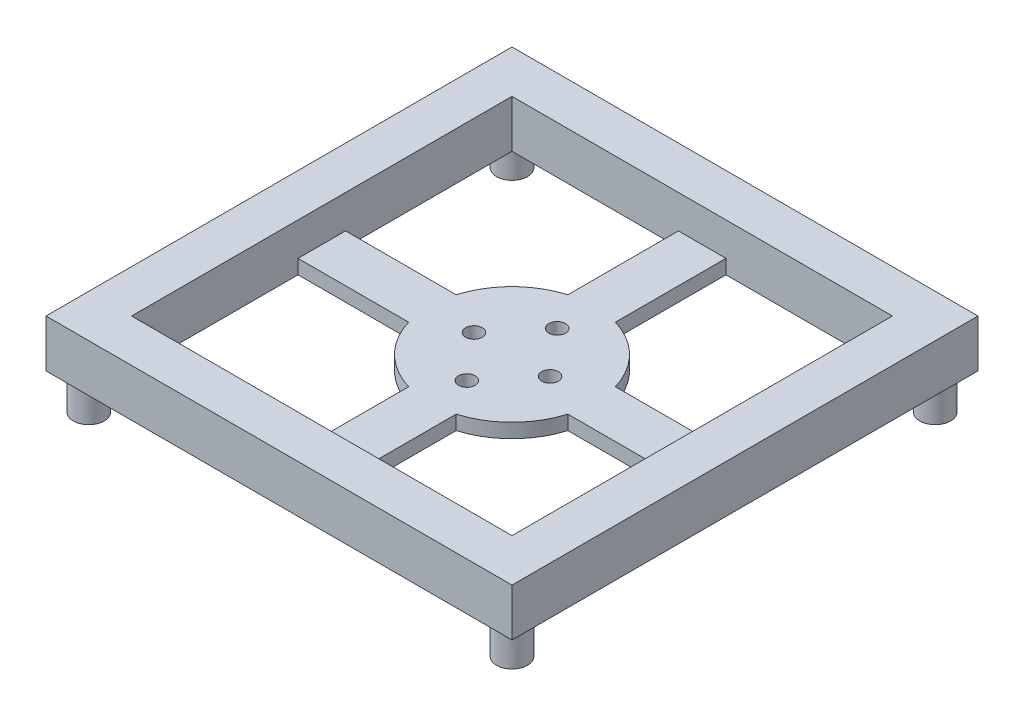
ISO-10303-21;
HEADER;
FILE_DESCRIPTION(('STEP AP214'),'2;1');
FILE_NAME('part.step','',(''),(''),'','','');
FILE_SCHEMA(('AUTOMOTIVE_DESIGN { 1 0 10303 214 1 1 1 1 }'));
ENDSEC;
DATA;
#1=APPLICATION_CONTEXT('core data for automotive mechanical design processes');
#2=APPLICATION_PROTOCOL_DEFINITION('international standard','automotive_design',2000,#1);
#3=PRODUCT_CONTEXT('',#1,'mechanical');
#4=PRODUCT('Part','Part','',(#3));
#5=PRODUCT_RELATED_PRODUCT_CATEGORY('part','',(#4));
#6=PRODUCT_DEFINITION_FORMATION('','',#4);
#7=PRODUCT_DEFINITION_CONTEXT('part definition',#1,'design');
#8=PRODUCT_DEFINITION('design','',#6,#7);
#9=PRODUCT_DEFINITION_SHAPE('','',#8);
#10=(LENGTH_UNIT() NAMED_UNIT(*) SI_UNIT(.MILLI.,.METRE.));
#11=(NAMED_UNIT(*) PLANE_ANGLE_UNIT() SI_UNIT($,.RADIAN.));
#12=(NAMED_UNIT(*) SI_UNIT($,.STERADIAN.) SOLID_ANGLE_UNIT());
#13=UNCERTAINTY_MEASURE_WITH_UNIT(LENGTH_MEASURE(1.E-05),#10,'distance_accuracy_value','');
#14=(GEOMETRIC_REPRESENTATION_CONTEXT(3) GLOBAL_UNCERTAINTY_ASSIGNED_CONTEXT((#13)) GLOBAL_UNIT_ASSIGNED_CONTEXT((#10,
#11,#12)) REPRESENTATION_CONTEXT('',''));
#15=CARTESIAN_POINT('',(0.,0.,0.));
#16=DIRECTION('',(0.,0.,1.));
#17=DIRECTION('',(1.,0.,0.));
#18=AXIS2_PLACEMENT_3D('',#15,#16,#17);
#19=CARTESIAN_POINT('',(-49.,0.,0.));
#20=DIRECTION('',(-1.,0.,0.));
#21=DIRECTION('',(0.,0.,1.));
#22=AXIS2_PLACEMENT_3D('',#19,#20,#21);
#23=PLANE('',#22);
#24=DIRECTION('',(0.,1.,0.));
#25=VECTOR('',#24,1.);
#26=CARTESIAN_POINT('',(-49.,-46.9999999999995,-49.));
#27=LINE('',#26,#25);
#28=CARTESIAN_POINT('',(-49.,40.0000000000005,-49.));
#29=VERTEX_POINT('',#28);
#30=CARTESIAN_POINT('',(-49.,50.,-49.));
#31=VERTEX_POINT('',#30);
#32=EDGE_CURVE('E215',#29,#31,#27,.T.);
#33=ORIENTED_EDGE('',*,*,#32,.F.);
#34=DIRECTION('',(0.,0.,1.));
#35=VECTOR('',#34,1.);
#36=CARTESIAN_POINT('',(-49.,40.,4.18977760661176E-13));
#37=LINE('',#36,#35);
#38=CARTESIAN_POINT('',(-49.,39.9999999999995,48.9999999999999));
#39=VERTEX_POINT('',#38);
#40=EDGE_CURVE('E52',#29,#39,#37,.T.);
#41=ORIENTED_EDGE('',*,*,#40,.T.);
#42=DIRECTION('',(0.,-1.,0.));
#43=VECTOR('',#42,1.);
#44=CARTESIAN_POINT('',(-49.,50.,49.));
#45=LINE('',#44,#43);
#46=CARTESIAN_POINT('',(-49.,50.,49.));
#47=VERTEX_POINT('',#46);
#48=EDGE_CURVE('E213',#47,#39,#45,.T.);
#49=ORIENTED_EDGE('',*,*,#48,.F.);
#50=DIRECTION('',(0.,0.,-1.));
#51=VECTOR('',#50,1.);
#52=CARTESIAN_POINT('',(-49.,50.,50.));
#53=LINE('',#52,#51);
#54=EDGE_CURVE('E206',#47,#31,#53,.T.);
#55=ORIENTED_EDGE('',*,*,#54,.T.);
#56=EDGE_LOOP('',(#33,#41,#49,#55));
#57=FACE_BOUND('',#56,.T.);
#58=ADVANCED_FACE('F37',(#57),#23,.T.);
#59=CARTESIAN_POINT('',(49.,0.,0.));
#60=DIRECTION('',(1.,0.,0.));
#61=DIRECTION('',(0.,0.,-1.));
#62=AXIS2_PLACEMENT_3D('',#59,#60,#61);
#63=PLANE('',#62);
#64=DIRECTION('',(0.,-1.,0.));
#65=VECTOR('',#64,1.);
#66=CARTESIAN_POINT('',(49.,50.,49.));
#67=LINE('',#66,#65);
#68=CARTESIAN_POINT('',(49.,50.,49.));
#69=VERTEX_POINT('',#68);
#70=CARTESIAN_POINT('',(49.,39.9999999999995,48.9999999999999));
#71=VERTEX_POINT('',#70);
#72=EDGE_CURVE('E582',#69,#71,#67,.T.);
#73=ORIENTED_EDGE('',*,*,#72,.T.);
#74=DIRECTION('',(0.,0.,-1.));
#75=VECTOR('',#74,1.);
#76=CARTESIAN_POINT('',(49.,40.,4.18977760661176E-13));
#77=LINE('',#76,#75);
#78=CARTESIAN_POINT('',(49.,40.0000000000005,-49.0000000000001));
#79=VERTEX_POINT('',#78);
#80=EDGE_CURVE('E201',#71,#79,#77,.T.);
#81=ORIENTED_EDGE('',*,*,#80,.T.);
#82=DIRECTION('',(0.,-1.,0.));
#83=VECTOR('',#82,1.);
#84=CARTESIAN_POINT('',(49.,50.,-49.));
#85=LINE('',#84,#83);
#86=CARTESIAN_POINT('',(49.,50.,-49.));
#87=VERTEX_POINT('',#86);
#88=EDGE_CURVE('E589',#87,#79,#85,.T.);
#89=ORIENTED_EDGE('',*,*,#88,.F.);
#90=DIRECTION('',(0.,0.,1.));
#91=VECTOR('',#90,1.);
#92=CARTESIAN_POINT('',(49.,50.,-50.));
#93=LINE('',#92,#91);
#94=EDGE_CURVE('E222',#87,#69,#93,.T.);
#95=ORIENTED_EDGE('',*,*,#94,.T.);
#96=EDGE_LOOP('',(#73,#81,#89,#95));
#97=FACE_BOUND('',#96,.T.);
#98=ADVANCED_FACE('F440',(#97),#63,.T.);
#99=CARTESIAN_POINT('',(0.,0.,49.));
#100=DIRECTION('',(0.,0.,1.));
#101=DIRECTION('',(1.,0.,0.));
#102=AXIS2_PLACEMENT_3D('',#99,#100,#101);
#103=PLANE('',#102);
#104=ORIENTED_EDGE('',*,*,#48,.T.);
#105=DIRECTION('',(1.,0.,0.));
#106=VECTOR('',#105,1.);
#107=CARTESIAN_POINT('',(0.,39.9999999999995,49.));
#108=LINE('',#107,#106);
#109=EDGE_CURVE('E198',#39,#71,#108,.T.);
#110=ORIENTED_EDGE('',*,*,#109,.T.);
#111=ORIENTED_EDGE('',*,*,#72,.F.);
#112=DIRECTION('',(-1.,0.,0.));
#113=VECTOR('',#112,1.);
#114=CARTESIAN_POINT('',(50.,50.,49.));
#115=LINE('',#114,#113);
#116=EDGE_CURVE('E207',#69,#47,#115,.T.);
#117=ORIENTED_EDGE('',*,*,#116,.T.);
#118=EDGE_LOOP('',(#104,#110,#111,#117));
#119=FACE_BOUND('',#118,.T.);
#120=ADVANCED_FACE('F218',(#119),#103,.T.);
#121=CARTESIAN_POINT('',(0.,0.,-49.));
#122=DIRECTION('',(0.,0.,-1.));
#123=DIRECTION('',(-1.,0.,0.));
#124=AXIS2_PLACEMENT_3D('',#121,#122,#123);
#125=PLANE('',#124);
#126=ORIENTED_EDGE('',*,*,#88,.T.);
#127=DIRECTION('',(-1.,0.,0.));
#128=VECTOR('',#127,1.);
#129=CARTESIAN_POINT('',(0.,40.0000000000005,-49.));
#130=LINE('',#129,#128);
#131=EDGE_CURVE('E583',#79,#29,#130,.T.);
#132=ORIENTED_EDGE('',*,*,#131,.T.);
#133=ORIENTED_EDGE('',*,*,#32,.T.);
#134=DIRECTION('',(1.,0.,0.));
#135=VECTOR('',#134,1.);
#136=CARTESIAN_POINT('',(-49.,50.,-49.));
#137=LINE('',#136,#135);
#138=EDGE_CURVE('E60',#31,#87,#137,.T.);
#139=ORIENTED_EDGE('',*,*,#138,.T.);
#140=EDGE_LOOP('',(#126,#132,#133,#139));
#141=FACE_BOUND('',#140,.T.);
#142=ADVANCED_FACE('F464',(#141),#125,.T.);
#143=CARTESIAN_POINT('',(0.,50.,0.));
#144=DIRECTION('',(0.,1.,0.));
#145=DIRECTION('',(0.,0.,1.));
#146=AXIS2_PLACEMENT_3D('',#143,#144,#145);
#147=PLANE('',#146);
#148=DIRECTION('',(1.,0.,0.));
#149=VECTOR('',#148,1.);
#150=CARTESIAN_POINT('',(-40.,50.,40.));
#151=LINE('',#150,#149);
#152=CARTESIAN_POINT('',(-40.,50.,40.));
#153=VERTEX_POINT('',#152);
#154=CARTESIAN_POINT('',(40.,50.,40.));
#155=VERTEX_POINT('',#154);
#156=EDGE_CURVE('E249',#153,#155,#151,.T.);
#157=ORIENTED_EDGE('',*,*,#156,.F.);
#158=DIRECTION('',(0.,0.,1.));
#159=VECTOR('',#158,1.);
#160=CARTESIAN_POINT('',(-40.,50.,-40.));
#161=LINE('',#160,#159);
#162=CARTESIAN_POINT('',(-40.,50.,-40.));
#163=VERTEX_POINT('',#162);
#164=EDGE_CURVE('E247',#163,#153,#161,.T.);
#165=ORIENTED_EDGE('',*,*,#164,.F.);
#166=DIRECTION('',(-1.,0.,0.));
#167=VECTOR('',#166,1.);
#168=CARTESIAN_POINT('',(40.,50.,-40.));
#169=LINE('',#168,#167);
#170=CARTESIAN_POINT('',(40.,50.,-40.));
#171=VERTEX_POINT('',#170);
#172=EDGE_CURVE('E245',#171,#163,#169,.T.);
#173=ORIENTED_EDGE('',*,*,#172,.F.);
#174=DIRECTION('',(0.,0.,-1.));
#175=VECTOR('',#174,1.);
#176=CARTESIAN_POINT('',(40.,50.,40.));
#177=LINE('',#176,#175);
#178=EDGE_CURVE('E216',#155,#171,#177,.T.);
#179=ORIENTED_EDGE('',*,*,#178,.F.);
#180=EDGE_LOOP('',(#157,#165,#173,#179));
#181=FACE_BOUND('',#180,.T.);
#182=ORIENTED_EDGE('',*,*,#94,.F.);
#183=ORIENTED_EDGE('',*,*,#138,.F.);
#184=ORIENTED_EDGE('',*,*,#54,.F.);
#185=ORIENTED_EDGE('',*,*,#116,.F.);
#186=EDGE_LOOP('',(#182,#183,#184,#185));
#187=FACE_BOUND('',#186,.T.);
#188=ADVANCED_FACE('F414',(#181,#187),#147,.T.);
#189=CARTESIAN_POINT('',(0.,40.,4.18977760661176E-13));
#190=DIRECTION('',(0.,1.,0.));
#191=DIRECTION('',(1.,0.,0.));
#192=AXIS2_PLACEMENT_3D('',#189,#190,#191);
#193=PLANE('',#192);
#194=CARTESIAN_POINT('',(44.500000000001,39.9999999999995,44.5));
#195=DIRECTION('',(0.,1.,0.));
#196=DIRECTION('',(0.,0.,1.));
#197=AXIS2_PLACEMENT_3D('',#194,#195,#196);
#198=CIRCLE('',#197,3.25);
#199=CARTESIAN_POINT('',(44.500000000001,39.9999999999995,47.75));
#200=VERTEX_POINT('',#199);
#201=EDGE_CURVE('E11',#200,#200,#198,.F.);
#202=ORIENTED_EDGE('',*,*,#201,.F.);
#203=EDGE_LOOP('',(#202));
#204=FACE_BOUND('',#203,.T.);
#205=CARTESIAN_POINT('',(-44.4999999999997,39.9999999999995,44.5000000000013));
#206=DIRECTION('',(0.,1.,0.));
#207=DIRECTION('',(0.,0.,1.));
#208=AXIS2_PLACEMENT_3D('',#205,#206,#207);
#209=CIRCLE('',#208,3.25);
#210=CARTESIAN_POINT('',(-44.4999999999997,39.9999999999995,47.7500000000013));
#211=VERTEX_POINT('',#210);
#212=EDGE_CURVE('E45',#211,#211,#209,.F.);
#213=ORIENTED_EDGE('',*,*,#212,.F.);
#214=EDGE_LOOP('',(#213));
#215=FACE_BOUND('',#214,.T.);
#216=CARTESIAN_POINT('',(-44.5000000000007,40.0000000000005,-44.4999999999995));
#217=DIRECTION('',(0.,1.,0.));
#218=DIRECTION('',(0.,0.,1.));
#219=AXIS2_PLACEMENT_3D('',#216,#217,#218);
#220=CIRCLE('',#219,3.25);
#221=CARTESIAN_POINT('',(-44.5000000000007,40.0000000000004,-41.2499999999995));
#222=VERTEX_POINT('',#221);
#223=EDGE_CURVE('E404',#222,#222,#220,.F.);
#224=ORIENTED_EDGE('',*,*,#223,.F.);
#225=EDGE_LOOP('',(#224));
#226=FACE_BOUND('',#225,.T.);
#227=CARTESIAN_POINT('',(44.5,40.0000000000005,-44.5000000000001));
#228=DIRECTION('',(0.,1.,0.));
#229=DIRECTION('',(0.,0.,1.));
#230=AXIS2_PLACEMENT_3D('',#227,#228,#229);
#231=CIRCLE('',#230,3.25);
#232=CARTESIAN_POINT('',(44.5,40.0000000000004,-41.2500000000001));
#233=VERTEX_POINT('',#232);
#234=EDGE_CURVE('E401',#233,#233,#231,.F.);
#235=ORIENTED_EDGE('',*,*,#234,.F.);
#236=EDGE_LOOP('',(#235));
#237=FACE_BOUND('',#236,.T.);
#238=ORIENTED_EDGE('',*,*,#131,.F.);
#239=ORIENTED_EDGE('',*,*,#80,.F.);
#240=ORIENTED_EDGE('',*,*,#109,.F.);
#241=ORIENTED_EDGE('',*,*,#40,.F.);
#242=EDGE_LOOP('',(#238,#239,#240,#241));
#243=FACE_BOUND('',#242,.T.);
#244=DIRECTION('',(-1.,0.,0.));
#245=VECTOR('',#244,1.);
#246=CARTESIAN_POINT('',(40.,40.,-40.));
#247=LINE('',#246,#245);
#248=CARTESIAN_POINT('',(-4.99999999999999,40.0000000000004,-40.));
#249=VERTEX_POINT('',#248);
#250=CARTESIAN_POINT('',(-40.,40.0000000000004,-40.));
#251=VERTEX_POINT('',#250);
#252=EDGE_CURVE('E230',#249,#251,#247,.T.);
#253=ORIENTED_EDGE('',*,*,#252,.T.);
#254=DIRECTION('',(0.,0.,1.));
#255=VECTOR('',#254,1.);
#256=CARTESIAN_POINT('',(-40.,40.,-40.));
#257=LINE('',#256,#255);
#258=CARTESIAN_POINT('',(-40.,40.,-4.99999999999957));
#259=VERTEX_POINT('',#258);
#260=EDGE_CURVE('E236',#251,#259,#257,.T.);
#261=ORIENTED_EDGE('',*,*,#260,.T.);
#262=DIRECTION('',(1.,0.,0.));
#263=VECTOR('',#262,1.);
#264=CARTESIAN_POINT('',(0.,40.0000000000001,-4.99999999999958));
#265=LINE('',#264,#263);
#266=CARTESIAN_POINT('',(-16.7425943498163,40.0000000000001,-4.99999999999958));
#267=VERTEX_POINT('',#266);
#268=EDGE_CURVE('E358',#259,#267,#265,.T.);
#269=ORIENTED_EDGE('',*,*,#268,.T.);
#270=CARTESIAN_POINT('',(0.,40.,4.18977760661176E-13));
#271=DIRECTION('',(0.,1.,0.));
#272=DIRECTION('',(1.,0.,0.));
#273=AXIS2_PLACEMENT_3D('',#270,#271,#272);
#274=CIRCLE('',#273,17.47325);
#275=CARTESIAN_POINT('',(-5.,40.0000000000002,-16.7425943498159));
#276=VERTEX_POINT('',#275);
#277=EDGE_CURVE('E355',#276,#267,#274,.T.);
#278=ORIENTED_EDGE('',*,*,#277,.F.);
#279=DIRECTION('',(0.,0.,1.));
#280=VECTOR('',#279,1.);
#281=CARTESIAN_POINT('',(-5.,40.,4.19628281964667E-13));
#282=LINE('',#281,#280);
#283=EDGE_CURVE('E353',#249,#276,#282,.T.);
#284=ORIENTED_EDGE('',*,*,#283,.F.);
#285=EDGE_LOOP('',(#253,#261,#269,#278,#284));
#286=FACE_BOUND('',#285,.T.);
#287=DIRECTION('',(0.,0.,-1.));
#288=VECTOR('',#287,1.);
#289=CARTESIAN_POINT('',(40.,40.,40.));
#290=LINE('',#289,#288);
#291=CARTESIAN_POINT('',(40.,40.0000000000001,-5.00000000000014));
#292=VERTEX_POINT('',#291);
#293=CARTESIAN_POINT('',(40.,40.0000000000004,-40.));
#294=VERTEX_POINT('',#293);
#295=EDGE_CURVE('E231',#292,#294,#290,.T.);
#296=ORIENTED_EDGE('',*,*,#295,.T.);
#297=CARTESIAN_POINT('',(5.,40.0000000000004,-40.));
#298=VERTEX_POINT('',#297);
#299=EDGE_CURVE('E232',#294,#298,#247,.T.);
#300=ORIENTED_EDGE('',*,*,#299,.T.);
#301=DIRECTION('',(0.,0.,1.));
#302=VECTOR('',#301,1.);
#303=CARTESIAN_POINT('',(5.,40.,4.18413975531484E-13));
#304=LINE('',#303,#302);
#305=CARTESIAN_POINT('',(5.,40.0000000000002,-16.7425943498159));
#306=VERTEX_POINT('',#305);
#307=EDGE_CURVE('E351',#298,#306,#304,.T.);
#308=ORIENTED_EDGE('',*,*,#307,.T.);
#309=CARTESIAN_POINT('',(0.,40.,4.18977760661176E-13));
#310=DIRECTION('',(0.,1.,0.));
#311=DIRECTION('',(1.,0.,0.));
#312=AXIS2_PLACEMENT_3D('',#309,#310,#311);
#313=CIRCLE('',#312,17.47325);
#314=CARTESIAN_POINT('',(16.7425943498163,40.0000000000001,-4.99999999999958));
#315=VERTEX_POINT('',#314);
#316=EDGE_CURVE('E348',#315,#306,#313,.T.);
#317=ORIENTED_EDGE('',*,*,#316,.F.);
#318=DIRECTION('',(1.,0.,0.));
#319=VECTOR('',#318,1.);
#320=CARTESIAN_POINT('',(0.,40.0000000000001,-4.99999999999958));
#321=LINE('',#320,#319);
#322=EDGE_CURVE('E346',#315,#292,#321,.T.);
#323=ORIENTED_EDGE('',*,*,#322,.T.);
#324=EDGE_LOOP('',(#296,#300,#308,#317,#323));
#325=FACE_BOUND('',#324,.T.);
#326=DIRECTION('',(1.,0.,0.));
#327=VECTOR('',#326,1.);
#328=CARTESIAN_POINT('',(-40.,40.,40.));
#329=LINE('',#328,#327);
#330=CARTESIAN_POINT('',(5.,39.9999999999996,40.));
#331=VERTEX_POINT('',#330);
#332=CARTESIAN_POINT('',(40.,39.9999999999996,40.));
#333=VERTEX_POINT('',#332);
#334=EDGE_CURVE('E239',#331,#333,#329,.T.);
#335=ORIENTED_EDGE('',*,*,#334,.T.);
#336=CARTESIAN_POINT('',(40.,40.,5.00000000000042));
#337=VERTEX_POINT('',#336);
#338=EDGE_CURVE('E227',#333,#337,#290,.T.);
#339=ORIENTED_EDGE('',*,*,#338,.T.);
#340=DIRECTION('',(1.,0.,0.));
#341=VECTOR('',#340,1.);
#342=CARTESIAN_POINT('',(0.,39.9999999999999,5.00000000000042));
#343=LINE('',#342,#341);
#344=CARTESIAN_POINT('',(16.7425943498163,39.9999999999999,5.00000000000042));
#345=VERTEX_POINT('',#344);
#346=EDGE_CURVE('E343',#345,#337,#343,.T.);
#347=ORIENTED_EDGE('',*,*,#346,.F.);
#348=CARTESIAN_POINT('',(0.,40.,4.18977760661176E-13));
#349=DIRECTION('',(0.,1.,0.));
#350=DIRECTION('',(1.,0.,0.));
#351=AXIS2_PLACEMENT_3D('',#348,#349,#350);
#352=CIRCLE('',#351,17.47325);
#353=CARTESIAN_POINT('',(5.,39.9999999999998,16.7425943498167));
#354=VERTEX_POINT('',#353);
#355=EDGE_CURVE('E295',#354,#345,#352,.T.);
#356=ORIENTED_EDGE('',*,*,#355,.F.);
#357=DIRECTION('',(0.,0.,1.));
#358=VECTOR('',#357,1.);
#359=CARTESIAN_POINT('',(5.,40.,4.18413975531484E-13));
#360=LINE('',#359,#358);
#361=EDGE_CURVE('E366',#354,#331,#360,.T.);
#362=ORIENTED_EDGE('',*,*,#361,.T.);
#363=EDGE_LOOP('',(#335,#339,#347,#356,#362));
#364=FACE_BOUND('',#363,.T.);
#365=CARTESIAN_POINT('',(-39.9999999999999,39.9999999999999,5.00000000000041));
#366=VERTEX_POINT('',#365);
#367=CARTESIAN_POINT('',(-40.,39.9999999999996,40.));
#368=VERTEX_POINT('',#367);
#369=EDGE_CURVE('E235',#366,#368,#257,.T.);
#370=ORIENTED_EDGE('',*,*,#369,.T.);
#371=CARTESIAN_POINT('',(-5.,39.9999999999996,40.));
#372=VERTEX_POINT('',#371);
#373=EDGE_CURVE('E240',#368,#372,#329,.T.);
#374=ORIENTED_EDGE('',*,*,#373,.T.);
#375=DIRECTION('',(0.,0.,1.));
#376=VECTOR('',#375,1.);
#377=CARTESIAN_POINT('',(-5.,40.,4.19628281964667E-13));
#378=LINE('',#377,#376);
#379=CARTESIAN_POINT('',(-5.,39.9999999999998,16.7425943498167));
#380=VERTEX_POINT('',#379);
#381=EDGE_CURVE('E364',#380,#372,#378,.T.);
#382=ORIENTED_EDGE('',*,*,#381,.F.);
#383=CARTESIAN_POINT('',(0.,40.,4.18977760661176E-13));
#384=DIRECTION('',(0.,1.,0.));
#385=DIRECTION('',(1.,0.,0.));
#386=AXIS2_PLACEMENT_3D('',#383,#384,#385);
#387=CIRCLE('',#386,17.47325);
#388=CARTESIAN_POINT('',(-16.7425943498163,39.9999999999999,5.00000000000042));
#389=VERTEX_POINT('',#388);
#390=EDGE_CURVE('E362',#389,#380,#387,.T.);
#391=ORIENTED_EDGE('',*,*,#390,.F.);
#392=DIRECTION('',(1.,0.,0.));
#393=VECTOR('',#392,1.);
#394=CARTESIAN_POINT('',(0.,39.9999999999999,5.00000000000042));
#395=LINE('',#394,#393);
#396=EDGE_CURVE('E360',#366,#389,#395,.T.);
#397=ORIENTED_EDGE('',*,*,#396,.F.);
#398=EDGE_LOOP('',(#370,#374,#382,#391,#397));
#399=FACE_BOUND('',#398,.T.);
#400=CARTESIAN_POINT('',(0.,39.9999999999999,9.50000000000042));
#401=DIRECTION('',(0.,1.,0.));
#402=DIRECTION('',(1.,0.,0.));
#403=AXIS2_PLACEMENT_3D('',#400,#401,#402);
#404=CIRCLE('',#403,1.75);
#405=CARTESIAN_POINT('',(1.75,39.9999999999999,9.50000000000042));
#406=VERTEX_POINT('',#405);
#407=EDGE_CURVE('E369',#406,#406,#404,.F.);
#408=ORIENTED_EDGE('',*,*,#407,.F.);
#409=EDGE_LOOP('',(#408));
#410=FACE_BOUND('',#409,.T.);
#411=CARTESIAN_POINT('',(-8.,40.,4.18977760661176E-13));
#412=DIRECTION('',(0.,1.,0.));
#413=DIRECTION('',(1.,0.,0.));
#414=AXIS2_PLACEMENT_3D('',#411,#412,#413);
#415=CIRCLE('',#414,1.75);
#416=CARTESIAN_POINT('',(-6.25,40.,4.18977760661176E-13));
#417=VERTEX_POINT('',#416);
#418=EDGE_CURVE('E372',#417,#417,#415,.F.);
#419=ORIENTED_EDGE('',*,*,#418,.F.);
#420=EDGE_LOOP('',(#419));
#421=FACE_BOUND('',#420,.T.);
#422=CARTESIAN_POINT('',(0.,40.0000000000001,-9.49999999999958));
#423=DIRECTION('',(0.,1.,0.));
#424=DIRECTION('',(1.,0.,0.));
#425=AXIS2_PLACEMENT_3D('',#422,#423,#424);
#426=CIRCLE('',#425,1.75);
#427=CARTESIAN_POINT('',(1.75,40.0000000000001,-9.49999999999958));
#428=VERTEX_POINT('',#427);
#429=EDGE_CURVE('E375',#428,#428,#426,.T.);
#430=ORIENTED_EDGE('',*,*,#429,.T.);
#431=EDGE_LOOP('',(#430));
#432=FACE_BOUND('',#431,.T.);
#433=CARTESIAN_POINT('',(8.,40.,4.18977760661176E-13));
#434=DIRECTION('',(0.,1.,0.));
#435=DIRECTION('',(1.,0.,0.));
#436=AXIS2_PLACEMENT_3D('',#433,#434,#435);
#437=CIRCLE('',#436,1.75);
#438=CARTESIAN_POINT('',(9.75,40.,4.18977760661176E-13));
#439=VERTEX_POINT('',#438);
#440=EDGE_CURVE('E300',#439,#439,#437,.T.);
#441=ORIENTED_EDGE('',*,*,#440,.T.);
#442=EDGE_LOOP('',(#441));
#443=FACE_BOUND('',#442,.T.);
#444=ADVANCED_FACE('F199',(#204,#215,#226,#237,#243,#286,#325,#364,#399,#410,#421,#432,#443),
#193,.F.);
#445=CARTESIAN_POINT('',(0.,43.,5.00000000000045));
#446=DIRECTION('',(0.,0.,-1.));
#447=DIRECTION('',(0.,1.,0.));
#448=AXIS2_PLACEMENT_3D('',#445,#446,#447);
#449=PLANE('',#448);
#450=DIRECTION('',(0.,-1.,0.));
#451=VECTOR('',#450,1.);
#452=CARTESIAN_POINT('',(40.,43.,5.00000000000045));
#453=LINE('',#452,#451);
#454=CARTESIAN_POINT('',(40.,43.,5.00000000000045));
#455=VERTEX_POINT('',#454);
#456=EDGE_CURVE('E293',#455,#337,#453,.T.);
#457=ORIENTED_EDGE('',*,*,#456,.F.);
#458=DIRECTION('',(1.,0.,0.));
#459=VECTOR('',#458,1.);
#460=CARTESIAN_POINT('',(0.,43.,5.00000000000045));
#461=LINE('',#460,#459);
#462=CARTESIAN_POINT('',(16.7425943498163,43.,5.00000000000045));
#463=VERTEX_POINT('',#462);
#464=EDGE_CURVE('E299',#463,#455,#461,.T.);
#465=ORIENTED_EDGE('',*,*,#464,.F.);
#466=DIRECTION('',(0.,-1.,0.));
#467=VECTOR('',#466,1.);
#468=CARTESIAN_POINT('',(16.7425943498163,43.,5.00000000000045));
#469=LINE('',#468,#467);
#470=EDGE_CURVE('E398',#463,#345,#469,.T.);
#471=ORIENTED_EDGE('',*,*,#470,.T.);
#472=ORIENTED_EDGE('',*,*,#346,.T.);
#473=EDGE_LOOP('',(#457,#465,#471,#472));
#474=FACE_BOUND('',#473,.T.);
#475=ADVANCED_FACE('F413',(#474),#449,.F.);
#476=CARTESIAN_POINT('',(0.,43.0000000000001,-4.99999999999955));
#477=DIRECTION('',(0.,0.,-1.));
#478=DIRECTION('',(0.,1.,0.));
#479=AXIS2_PLACEMENT_3D('',#476,#477,#478);
#480=PLANE('',#479);
#481=DIRECTION('',(1.,0.,0.));
#482=VECTOR('',#481,1.);
#483=CARTESIAN_POINT('',(0.,43.0000000000001,-4.99999999999955));
#484=LINE('',#483,#482);
#485=CARTESIAN_POINT('',(16.7425943498163,43.0000000000001,-4.99999999999955));
#486=VERTEX_POINT('',#485);
#487=CARTESIAN_POINT('',(40.,43.0000000000001,-4.99999999999955));
#488=VERTEX_POINT('',#487);
#489=EDGE_CURVE('E303',#486,#488,#484,.T.);
#490=ORIENTED_EDGE('',*,*,#489,.T.);
#491=DIRECTION('',(0.,-1.,0.));
#492=VECTOR('',#491,1.);
#493=CARTESIAN_POINT('',(40.,43.0000000000001,-4.99999999999955));
#494=LINE('',#493,#492);
#495=EDGE_CURVE('E290',#488,#292,#494,.T.);
#496=ORIENTED_EDGE('',*,*,#495,.T.);
#497=ORIENTED_EDGE('',*,*,#322,.F.);
#498=DIRECTION('',(0.,-1.,0.));
#499=VECTOR('',#498,1.);
#500=CARTESIAN_POINT('',(16.7425943498163,43.0000000000001,-4.99999999999955));
#501=LINE('',#500,#499);
#502=EDGE_CURVE('E396',#486,#315,#501,.T.);
#503=ORIENTED_EDGE('',*,*,#502,.F.);
#504=EDGE_LOOP('',(#490,#496,#497,#503));
#505=FACE_BOUND('',#504,.T.);
#506=ADVANCED_FACE('F517',(#505),#480,.T.);
#507=CARTESIAN_POINT('',(5.,43.,4.49837307581072E-13));
#508=DIRECTION('',(1.,0.,0.));
#509=DIRECTION('',(0.,0.,-1.));
#510=AXIS2_PLACEMENT_3D('',#507,#508,#509);
#511=PLANE('',#510);
#512=ORIENTED_EDGE('',*,*,#307,.F.);
#513=DIRECTION('',(0.,1.,0.));
#514=VECTOR('',#513,1.);
#515=CARTESIAN_POINT('',(5.,43.,-40.));
#516=LINE('',#515,#514);
#517=CARTESIAN_POINT('',(5.,43.0000000000004,-40.));
#518=VERTEX_POINT('',#517);
#519=EDGE_CURVE('E267',#298,#518,#516,.T.);
#520=ORIENTED_EDGE('',*,*,#519,.T.);
#521=DIRECTION('',(0.,0.,1.));
#522=VECTOR('',#521,1.);
#523=CARTESIAN_POINT('',(5.,43.,4.49837307581072E-13));
#524=LINE('',#523,#522);
#525=CARTESIAN_POINT('',(5.,43.0000000000002,-16.7425943498158));
#526=VERTEX_POINT('',#525);
#527=EDGE_CURVE('E309',#518,#526,#524,.T.);
#528=ORIENTED_EDGE('',*,*,#527,.T.);
#529=DIRECTION('',(0.,-1.,0.));
#530=VECTOR('',#529,1.);
#531=CARTESIAN_POINT('',(5.,43.0000000000002,-16.7425943498158));
#532=LINE('',#531,#530);
#533=EDGE_CURVE('E393',#526,#306,#532,.T.);
#534=ORIENTED_EDGE('',*,*,#533,.T.);
#535=EDGE_LOOP('',(#512,#520,#528,#534));
#536=FACE_BOUND('',#535,.T.);
#537=ADVANCED_FACE('F513',(#536),#511,.T.);
#538=CARTESIAN_POINT('',(-5.,43.,4.51051614014255E-13));
#539=DIRECTION('',(1.,0.,0.));
#540=DIRECTION('',(0.,0.,-1.));
#541=AXIS2_PLACEMENT_3D('',#538,#539,#540);
#542=PLANE('',#541);
#543=DIRECTION('',(0.,1.,0.));
#544=VECTOR('',#543,1.);
#545=CARTESIAN_POINT('',(-5.,43.,-40.));
#546=LINE('',#545,#544);
#547=CARTESIAN_POINT('',(-5.,43.0000000000004,-40.));
#548=VERTEX_POINT('',#547);
#549=EDGE_CURVE('E265',#249,#548,#546,.T.);
#550=ORIENTED_EDGE('',*,*,#549,.F.);
#551=ORIENTED_EDGE('',*,*,#283,.T.);
#552=DIRECTION('',(0.,-1.,0.));
#553=VECTOR('',#552,1.);
#554=CARTESIAN_POINT('',(-5.,43.0000000000002,-16.7425943498158));
#555=LINE('',#554,#553);
#556=CARTESIAN_POINT('',(-5.,43.0000000000002,-16.7425943498158));
#557=VERTEX_POINT('',#556);
#558=EDGE_CURVE('E390',#557,#276,#555,.T.);
#559=ORIENTED_EDGE('',*,*,#558,.F.);
#560=DIRECTION('',(0.,0.,1.));
#561=VECTOR('',#560,1.);
#562=CARTESIAN_POINT('',(-5.,43.,4.51051614014255E-13));
#563=LINE('',#562,#561);
#564=EDGE_CURVE('E311',#548,#557,#563,.T.);
#565=ORIENTED_EDGE('',*,*,#564,.F.);
#566=EDGE_LOOP('',(#550,#551,#559,#565));
#567=FACE_BOUND('',#566,.T.);
#568=ADVANCED_FACE('F505',(#567),#542,.F.);
#569=CARTESIAN_POINT('',(0.,43.0000000000001,-4.99999999999955));
#570=DIRECTION('',(0.,0.,-1.));
#571=DIRECTION('',(0.,1.,0.));
#572=AXIS2_PLACEMENT_3D('',#569,#570,#571);
#573=PLANE('',#572);
#574=ORIENTED_EDGE('',*,*,#268,.F.);
#575=DIRECTION('',(0.,1.,0.));
#576=VECTOR('',#575,1.);
#577=CARTESIAN_POINT('',(-40.,43.0000000000001,-4.99999999999955));
#578=LINE('',#577,#576);
#579=CARTESIAN_POINT('',(-40.,43.0000000000001,-4.99999999999955));
#580=VERTEX_POINT('',#579);
#581=EDGE_CURVE('E275',#259,#580,#578,.T.);
#582=ORIENTED_EDGE('',*,*,#581,.T.);
#583=DIRECTION('',(1.,0.,0.));
#584=VECTOR('',#583,1.);
#585=CARTESIAN_POINT('',(0.,43.0000000000001,-4.99999999999955));
#586=LINE('',#585,#584);
#587=CARTESIAN_POINT('',(-16.7425943498163,43.0000000000001,-4.99999999999955));
#588=VERTEX_POINT('',#587);
#589=EDGE_CURVE('E316',#580,#588,#586,.T.);
#590=ORIENTED_EDGE('',*,*,#589,.T.);
#591=DIRECTION('',(0.,-1.,0.));
#592=VECTOR('',#591,1.);
#593=CARTESIAN_POINT('',(-16.7425943498163,43.0000000000001,-4.99999999999955));
#594=LINE('',#593,#592);
#595=EDGE_CURVE('E387',#588,#267,#594,.T.);
#596=ORIENTED_EDGE('',*,*,#595,.T.);
#597=EDGE_LOOP('',(#574,#582,#590,#596));
#598=FACE_BOUND('',#597,.T.);
#599=ADVANCED_FACE('F501',(#598),#573,.T.);
#600=CARTESIAN_POINT('',(0.,43.,5.00000000000045));
#601=DIRECTION('',(0.,0.,-1.));
#602=DIRECTION('',(0.,1.,0.));
#603=AXIS2_PLACEMENT_3D('',#600,#601,#602);
#604=PLANE('',#603);
#605=DIRECTION('',(0.,1.,0.));
#606=VECTOR('',#605,1.);
#607=CARTESIAN_POINT('',(-40.,43.,5.00000000000045));
#608=LINE('',#607,#606);
#609=CARTESIAN_POINT('',(-40.,43.,5.00000000000045));
#610=VERTEX_POINT('',#609);
#611=EDGE_CURVE('E273',#366,#610,#608,.T.);
#612=ORIENTED_EDGE('',*,*,#611,.F.);
#613=ORIENTED_EDGE('',*,*,#396,.T.);
#614=DIRECTION('',(0.,-1.,0.));
#615=VECTOR('',#614,1.);
#616=CARTESIAN_POINT('',(-16.7425943498163,43.,5.00000000000045));
#617=LINE('',#616,#615);
#618=CARTESIAN_POINT('',(-16.7425943498163,43.,5.00000000000045));
#619=VERTEX_POINT('',#618);
#620=EDGE_CURVE('E384',#619,#389,#617,.T.);
#621=ORIENTED_EDGE('',*,*,#620,.F.);
#622=DIRECTION('',(1.,0.,0.));
#623=VECTOR('',#622,1.);
#624=CARTESIAN_POINT('',(0.,43.,5.00000000000045));
#625=LINE('',#624,#623);
#626=EDGE_CURVE('E318',#610,#619,#625,.T.);
#627=ORIENTED_EDGE('',*,*,#626,.F.);
#628=EDGE_LOOP('',(#612,#613,#621,#627));
#629=FACE_BOUND('',#628,.T.);
#630=ADVANCED_FACE('F493',(#629),#604,.F.);
#631=CARTESIAN_POINT('',(-5.,43.,4.51051614014255E-13));
#632=DIRECTION('',(1.,0.,0.));
#633=DIRECTION('',(0.,0.,-1.));
#634=AXIS2_PLACEMENT_3D('',#631,#632,#633);
#635=PLANE('',#634);
#636=DIRECTION('',(0.,-1.,0.));
#637=VECTOR('',#636,1.);
#638=CARTESIAN_POINT('',(-4.99999999999999,43.,40.));
#639=LINE('',#638,#637);
#640=CARTESIAN_POINT('',(-4.99999999999999,42.9999999999996,40.));
#641=VERTEX_POINT('',#640);
#642=EDGE_CURVE('E284',#641,#372,#639,.T.);
#643=ORIENTED_EDGE('',*,*,#642,.F.);
#644=DIRECTION('',(0.,0.,1.));
#645=VECTOR('',#644,1.);
#646=CARTESIAN_POINT('',(-5.,43.,4.51051614014255E-13));
#647=LINE('',#646,#645);
#648=CARTESIAN_POINT('',(-5.,42.9999999999998,16.7425943498167));
#649=VERTEX_POINT('',#648);
#650=EDGE_CURVE('E322',#649,#641,#647,.T.);
#651=ORIENTED_EDGE('',*,*,#650,.F.);
#652=DIRECTION('',(0.,-1.,0.));
#653=VECTOR('',#652,1.);
#654=CARTESIAN_POINT('',(-5.,42.9999999999998,16.7425943498167));
#655=LINE('',#654,#653);
#656=EDGE_CURVE('E381',#649,#380,#655,.T.);
#657=ORIENTED_EDGE('',*,*,#656,.T.);
#658=ORIENTED_EDGE('',*,*,#381,.T.);
#659=EDGE_LOOP('',(#643,#651,#657,#658));
#660=FACE_BOUND('',#659,.T.);
#661=ADVANCED_FACE('F489',(#660),#635,.F.);
#662=CARTESIAN_POINT('',(5.,43.,4.49837307581072E-13));
#663=DIRECTION('',(1.,0.,0.));
#664=DIRECTION('',(0.,0.,-1.));
#665=AXIS2_PLACEMENT_3D('',#662,#663,#664);
#666=PLANE('',#665);
#667=DIRECTION('',(0.,0.,1.));
#668=VECTOR('',#667,1.);
#669=CARTESIAN_POINT('',(5.,43.,4.49837307581072E-13));
#670=LINE('',#669,#668);
#671=CARTESIAN_POINT('',(5.,42.9999999999998,16.7425943498167));
#672=VERTEX_POINT('',#671);
#673=CARTESIAN_POINT('',(5.,42.9999999999996,40.));
#674=VERTEX_POINT('',#673);
#675=EDGE_CURVE('E325',#672,#674,#670,.T.);
#676=ORIENTED_EDGE('',*,*,#675,.T.);
#677=DIRECTION('',(0.,-1.,0.));
#678=VECTOR('',#677,1.);
#679=CARTESIAN_POINT('',(5.,43.,40.));
#680=LINE('',#679,#678);
#681=EDGE_CURVE('E281',#674,#331,#680,.T.);
#682=ORIENTED_EDGE('',*,*,#681,.T.);
#683=ORIENTED_EDGE('',*,*,#361,.F.);
#684=DIRECTION('',(0.,-1.,0.));
#685=VECTOR('',#684,1.);
#686=CARTESIAN_POINT('',(5.,42.9999999999998,16.7425943498167));
#687=LINE('',#686,#685);
#688=EDGE_CURVE('E340',#672,#354,#687,.T.);
#689=ORIENTED_EDGE('',*,*,#688,.F.);
#690=EDGE_LOOP('',(#676,#682,#683,#689));
#691=FACE_BOUND('',#690,.T.);
#692=ADVANCED_FACE('F468',(#691),#666,.T.);
#693=CARTESIAN_POINT('',(0.,43.,4.50401092710764E-13));
#694=DIRECTION('',(0.,1.,0.));
#695=DIRECTION('',(1.,0.,0.));
#696=AXIS2_PLACEMENT_3D('',#693,#694,#695);
#697=PLANE('',#696);
#698=CARTESIAN_POINT('',(0.,42.9999999999999,9.50000000000045));
#699=DIRECTION('',(0.,1.,0.));
#700=DIRECTION('',(1.,0.,0.));
#701=AXIS2_PLACEMENT_3D('',#698,#699,#700);
#702=CIRCLE('',#701,1.75);
#703=CARTESIAN_POINT('',(1.75,42.9999999999999,9.50000000000045));
#704=VERTEX_POINT('',#703);
#705=EDGE_CURVE('E328',#704,#704,#702,.F.);
#706=ORIENTED_EDGE('',*,*,#705,.T.);
#707=EDGE_LOOP('',(#706));
#708=FACE_BOUND('',#707,.T.);
#709=CARTESIAN_POINT('',(-8.,43.,4.50401092710764E-13));
#710=DIRECTION('',(0.,1.,0.));
#711=DIRECTION('',(1.,0.,0.));
#712=AXIS2_PLACEMENT_3D('',#709,#710,#711);
#713=CIRCLE('',#712,1.75);
#714=CARTESIAN_POINT('',(-6.25,43.,4.50401092710764E-13));
#715=VERTEX_POINT('',#714);
#716=EDGE_CURVE('E331',#715,#715,#713,.F.);
#717=ORIENTED_EDGE('',*,*,#716,.T.);
#718=EDGE_LOOP('',(#717));
#719=FACE_BOUND('',#718,.T.);
#720=CARTESIAN_POINT('',(0.,43.0000000000001,-9.49999999999955));
#721=DIRECTION('',(0.,1.,0.));
#722=DIRECTION('',(1.,0.,0.));
#723=AXIS2_PLACEMENT_3D('',#720,#721,#722);
#724=CIRCLE('',#723,1.75);
#725=CARTESIAN_POINT('',(1.75,43.0000000000001,-9.49999999999955));
#726=VERTEX_POINT('',#725);
#727=EDGE_CURVE('E334',#726,#726,#724,.T.);
#728=ORIENTED_EDGE('',*,*,#727,.F.);
#729=EDGE_LOOP('',(#728));
#730=FACE_BOUND('',#729,.T.);
#731=CARTESIAN_POINT('',(8.,43.,4.50401092710764E-13));
#732=DIRECTION('',(0.,1.,0.));
#733=DIRECTION('',(1.,0.,0.));
#734=AXIS2_PLACEMENT_3D('',#731,#732,#733);
#735=CIRCLE('',#734,1.75);
#736=CARTESIAN_POINT('',(9.75,43.,4.50401092710764E-13));
#737=VERTEX_POINT('',#736);
#738=EDGE_CURVE('E337',#737,#737,#735,.T.);
#739=ORIENTED_EDGE('',*,*,#738,.F.);
#740=EDGE_LOOP('',(#739));
#741=FACE_BOUND('',#740,.T.);
#742=ORIENTED_EDGE('',*,*,#464,.T.);
#743=DIRECTION('',(0.,0.,-1.));
#744=VECTOR('',#743,1.);
#745=CARTESIAN_POINT('',(40.,43.,4.53870539662718E-13));
#746=LINE('',#745,#744);
#747=EDGE_CURVE('E287',#455,#488,#746,.T.);
#748=ORIENTED_EDGE('',*,*,#747,.T.);
#749=ORIENTED_EDGE('',*,*,#489,.F.);
#750=CARTESIAN_POINT('',(0.,43.,4.50401092710764E-13));
#751=DIRECTION('',(0.,1.,0.));
#752=DIRECTION('',(1.,0.,0.));
#753=AXIS2_PLACEMENT_3D('',#750,#751,#752);
#754=CIRCLE('',#753,17.47325);
#755=EDGE_CURVE('E306',#486,#526,#754,.T.);
#756=ORIENTED_EDGE('',*,*,#755,.T.);
#757=ORIENTED_EDGE('',*,*,#527,.F.);
#758=DIRECTION('',(-1.,0.,0.));
#759=VECTOR('',#758,1.);
#760=CARTESIAN_POINT('',(0.,43.0000000000004,-40.));
#761=LINE('',#760,#759);
#762=EDGE_CURVE('E254',#518,#548,#761,.T.);
#763=ORIENTED_EDGE('',*,*,#762,.T.);
#764=ORIENTED_EDGE('',*,*,#564,.T.);
#765=CARTESIAN_POINT('',(0.,43.,4.50401092710764E-13));
#766=DIRECTION('',(0.,1.,0.));
#767=DIRECTION('',(1.,0.,0.));
#768=AXIS2_PLACEMENT_3D('',#765,#766,#767);
#769=CIRCLE('',#768,17.47325);
#770=EDGE_CURVE('E313',#557,#588,#769,.T.);
#771=ORIENTED_EDGE('',*,*,#770,.T.);
#772=ORIENTED_EDGE('',*,*,#589,.F.);
#773=DIRECTION('',(0.,0.,1.));
#774=VECTOR('',#773,1.);
#775=CARTESIAN_POINT('',(-40.,43.,4.50401092710764E-13));
#776=LINE('',#775,#774);
#777=EDGE_CURVE('E270',#580,#610,#776,.T.);
#778=ORIENTED_EDGE('',*,*,#777,.T.);
#779=ORIENTED_EDGE('',*,*,#626,.T.);
#780=CARTESIAN_POINT('',(0.,43.,4.50401092710764E-13));
#781=DIRECTION('',(0.,1.,0.));
#782=DIRECTION('',(1.,0.,0.));
#783=AXIS2_PLACEMENT_3D('',#780,#781,#782);
#784=CIRCLE('',#783,17.47325);
#785=EDGE_CURVE('E320',#619,#649,#784,.T.);
#786=ORIENTED_EDGE('',*,*,#785,.T.);
#787=ORIENTED_EDGE('',*,*,#650,.T.);
#788=DIRECTION('',(1.,0.,0.));
#789=VECTOR('',#788,1.);
#790=CARTESIAN_POINT('',(0.,42.9999999999996,40.));
#791=LINE('',#790,#789);
#792=EDGE_CURVE('E278',#641,#674,#791,.T.);
#793=ORIENTED_EDGE('',*,*,#792,.T.);
#794=ORIENTED_EDGE('',*,*,#675,.F.);
#795=CARTESIAN_POINT('',(0.,43.,4.50401092710764E-13));
#796=DIRECTION('',(0.,1.,0.));
#797=DIRECTION('',(1.,0.,0.));
#798=AXIS2_PLACEMENT_3D('',#795,#796,#797);
#799=CIRCLE('',#798,17.47325);
#800=EDGE_CURVE('E296',#672,#463,#799,.T.);
#801=ORIENTED_EDGE('',*,*,#800,.T.);
#802=EDGE_LOOP('',(#742,#748,#749,#756,#757,#763,#764,#771,#772,#778,#779,#786,#787,#793,#794,#801));
#803=FACE_BOUND('',#802,.T.);
#804=ADVANCED_FACE('F466',(#708,#719,#730,#741,#803),#697,.T.);
#805=CARTESIAN_POINT('',(0.,43.,4.50401092710764E-13));
#806=DIRECTION('',(0.,-1.,0.));
#807=DIRECTION('',(-1.,0.,0.));
#808=AXIS2_PLACEMENT_3D('',#805,#806,#807);
#809=CYLINDRICAL_SURFACE('',#808,17.47325);
#810=ORIENTED_EDGE('',*,*,#355,.T.);
#811=ORIENTED_EDGE('',*,*,#470,.F.);
#812=ORIENTED_EDGE('',*,*,#800,.F.);
#813=ORIENTED_EDGE('',*,*,#688,.T.);
#814=EDGE_LOOP('',(#810,#811,#812,#813));
#815=FACE_BOUND('',#814,.T.);
#816=ADVANCED_FACE('F39',(#815),#809,.T.);
#817=CARTESIAN_POINT('',(0.,43.,4.50401092710764E-13));
#818=DIRECTION('',(0.,-1.,0.));
#819=DIRECTION('',(-1.,0.,0.));
#820=AXIS2_PLACEMENT_3D('',#817,#818,#819);
#821=CYLINDRICAL_SURFACE('',#820,17.47325);
#822=ORIENTED_EDGE('',*,*,#316,.T.);
#823=ORIENTED_EDGE('',*,*,#533,.F.);
#824=ORIENTED_EDGE('',*,*,#755,.F.);
#825=ORIENTED_EDGE('',*,*,#502,.T.);
#826=EDGE_LOOP('',(#822,#823,#824,#825));
#827=FACE_BOUND('',#826,.T.);
#828=ADVANCED_FACE('F509',(#827),#821,.T.);
#829=CARTESIAN_POINT('',(0.,43.,4.50401092710764E-13));
#830=DIRECTION('',(0.,-1.,0.));
#831=DIRECTION('',(-1.,0.,0.));
#832=AXIS2_PLACEMENT_3D('',#829,#830,#831);
#833=CYLINDRICAL_SURFACE('',#832,17.47325);
#834=ORIENTED_EDGE('',*,*,#277,.T.);
#835=ORIENTED_EDGE('',*,*,#595,.F.);
#836=ORIENTED_EDGE('',*,*,#770,.F.);
#837=ORIENTED_EDGE('',*,*,#558,.T.);
#838=EDGE_LOOP('',(#834,#835,#836,#837));
#839=FACE_BOUND('',#838,.T.);
#840=ADVANCED_FACE('F497',(#839),#833,.T.);
#841=CARTESIAN_POINT('',(0.,43.,4.50401092710764E-13));
#842=DIRECTION('',(0.,-1.,0.));
#843=DIRECTION('',(-1.,0.,0.));
#844=AXIS2_PLACEMENT_3D('',#841,#842,#843);
#845=CYLINDRICAL_SURFACE('',#844,17.47325);
#846=ORIENTED_EDGE('',*,*,#390,.T.);
#847=ORIENTED_EDGE('',*,*,#656,.F.);
#848=ORIENTED_EDGE('',*,*,#785,.F.);
#849=ORIENTED_EDGE('',*,*,#620,.T.);
#850=EDGE_LOOP('',(#846,#847,#848,#849));
#851=FACE_BOUND('',#850,.T.);
#852=ADVANCED_FACE('F479',(#851),#845,.T.);
#853=CARTESIAN_POINT('',(0.,43.0000000000001,-9.49999999999955));
#854=DIRECTION('',(0.,-1.,0.));
#855=DIRECTION('',(-1.,0.,0.));
#856=AXIS2_PLACEMENT_3D('',#853,#854,#855);
#857=CYLINDRICAL_SURFACE('',#856,1.75);
#858=ORIENTED_EDGE('',*,*,#727,.T.);
#859=EDGE_LOOP('',(#858));
#860=FACE_BOUND('',#859,.T.);
#861=ORIENTED_EDGE('',*,*,#429,.F.);
#862=EDGE_LOOP('',(#861));
#863=FACE_BOUND('',#862,.T.);
#864=ADVANCED_FACE('F475',(#860,#863),#857,.F.);
#865=CARTESIAN_POINT('',(-8.,43.,4.50401092710764E-13));
#866=DIRECTION('',(0.,-1.,0.));
#867=DIRECTION('',(-1.,0.,0.));
#868=AXIS2_PLACEMENT_3D('',#865,#866,#867);
#869=CYLINDRICAL_SURFACE('',#868,1.75);
#870=ORIENTED_EDGE('',*,*,#716,.F.);
#871=EDGE_LOOP('',(#870));
#872=FACE_BOUND('',#871,.T.);
#873=ORIENTED_EDGE('',*,*,#418,.T.);
#874=EDGE_LOOP('',(#873));
#875=FACE_BOUND('',#874,.T.);
#876=ADVANCED_FACE('F478',(#872,#875),#869,.F.);
#877=CARTESIAN_POINT('',(0.,42.9999999999999,9.50000000000045));
#878=DIRECTION('',(0.,-1.,0.));
#879=DIRECTION('',(-1.,0.,0.));
#880=AXIS2_PLACEMENT_3D('',#877,#878,#879);
#881=CYLINDRICAL_SURFACE('',#880,1.75);
#882=ORIENTED_EDGE('',*,*,#705,.F.);
#883=EDGE_LOOP('',(#882));
#884=FACE_BOUND('',#883,.T.);
#885=ORIENTED_EDGE('',*,*,#407,.T.);
#886=EDGE_LOOP('',(#885));
#887=FACE_BOUND('',#886,.T.);
#888=ADVANCED_FACE('F473',(#884,#887),#881,.F.);
#889=CARTESIAN_POINT('',(8.,43.,4.50401092710764E-13));
#890=DIRECTION('',(0.,-1.,0.));
#891=DIRECTION('',(-1.,0.,0.));
#892=AXIS2_PLACEMENT_3D('',#889,#890,#891);
#893=CYLINDRICAL_SURFACE('',#892,1.75);
#894=ORIENTED_EDGE('',*,*,#738,.T.);
#895=EDGE_LOOP('',(#894));
#896=FACE_BOUND('',#895,.T.);
#897=ORIENTED_EDGE('',*,*,#440,.F.);
#898=EDGE_LOOP('',(#897));
#899=FACE_BOUND('',#898,.T.);
#900=ADVANCED_FACE('F460',(#896,#899),#893,.F.);
#901=CARTESIAN_POINT('',(40.,40.,40.));
#902=DIRECTION('',(1.,0.,0.));
#903=DIRECTION('',(0.,0.,-1.));
#904=AXIS2_PLACEMENT_3D('',#901,#902,#903);
#905=PLANE('',#904);
#906=ORIENTED_EDGE('',*,*,#495,.F.);
#907=ORIENTED_EDGE('',*,*,#747,.F.);
#908=ORIENTED_EDGE('',*,*,#456,.T.);
#909=ORIENTED_EDGE('',*,*,#338,.F.);
#910=DIRECTION('',(0.,1.,0.));
#911=VECTOR('',#910,1.);
#912=CARTESIAN_POINT('',(40.,40.,40.));
#913=LINE('',#912,#911);
#914=EDGE_CURVE('E251',#333,#155,#913,.T.);
#915=ORIENTED_EDGE('',*,*,#914,.T.);
#916=ORIENTED_EDGE('',*,*,#178,.T.);
#917=DIRECTION('',(0.,1.,0.));
#918=VECTOR('',#917,1.);
#919=CARTESIAN_POINT('',(40.,40.,-40.));
#920=LINE('',#919,#918);
#921=EDGE_CURVE('E243',#294,#171,#920,.T.);
#922=ORIENTED_EDGE('',*,*,#921,.F.);
#923=ORIENTED_EDGE('',*,*,#295,.F.);
#924=EDGE_LOOP('',(#906,#907,#908,#909,#915,#916,#922,#923));
#925=FACE_BOUND('',#924,.T.);
#926=ADVANCED_FACE('F453',(#925),#905,.F.);
#927=CARTESIAN_POINT('',(-40.,40.,40.));
#928=DIRECTION('',(0.,0.,1.));
#929=DIRECTION('',(1.,0.,0.));
#930=AXIS2_PLACEMENT_3D('',#927,#928,#929);
#931=PLANE('',#930);
#932=ORIENTED_EDGE('',*,*,#681,.F.);
#933=ORIENTED_EDGE('',*,*,#792,.F.);
#934=ORIENTED_EDGE('',*,*,#642,.T.);
#935=ORIENTED_EDGE('',*,*,#373,.F.);
#936=DIRECTION('',(0.,1.,0.));
#937=VECTOR('',#936,1.);
#938=CARTESIAN_POINT('',(-40.,40.,40.));
#939=LINE('',#938,#937);
#940=EDGE_CURVE('E255',#368,#153,#939,.T.);
#941=ORIENTED_EDGE('',*,*,#940,.T.);
#942=ORIENTED_EDGE('',*,*,#156,.T.);
#943=ORIENTED_EDGE('',*,*,#914,.F.);
#944=ORIENTED_EDGE('',*,*,#334,.F.);
#945=EDGE_LOOP('',(#932,#933,#934,#935,#941,#942,#943,#944));
#946=FACE_BOUND('',#945,.T.);
#947=ADVANCED_FACE('F450',(#946),#931,.F.);
#948=CARTESIAN_POINT('',(-40.,40.,-40.));
#949=DIRECTION('',(-1.,0.,0.));
#950=DIRECTION('',(0.,0.,1.));
#951=AXIS2_PLACEMENT_3D('',#948,#949,#950);
#952=PLANE('',#951);
#953=ORIENTED_EDGE('',*,*,#611,.T.);
#954=ORIENTED_EDGE('',*,*,#777,.F.);
#955=ORIENTED_EDGE('',*,*,#581,.F.);
#956=ORIENTED_EDGE('',*,*,#260,.F.);
#957=DIRECTION('',(0.,1.,0.));
#958=VECTOR('',#957,1.);
#959=CARTESIAN_POINT('',(-40.,40.,-40.));
#960=LINE('',#959,#958);
#961=EDGE_CURVE('E258',#251,#163,#960,.T.);
#962=ORIENTED_EDGE('',*,*,#961,.T.);
#963=ORIENTED_EDGE('',*,*,#164,.T.);
#964=ORIENTED_EDGE('',*,*,#940,.F.);
#965=ORIENTED_EDGE('',*,*,#369,.F.);
#966=EDGE_LOOP('',(#953,#954,#955,#956,#962,#963,#964,#965));
#967=FACE_BOUND('',#966,.T.);
#968=ADVANCED_FACE('F434',(#967),#952,.F.);
#969=CARTESIAN_POINT('',(40.,40.,-40.));
#970=DIRECTION('',(0.,0.,-1.));
#971=DIRECTION('',(-1.,0.,0.));
#972=AXIS2_PLACEMENT_3D('',#969,#970,#971);
#973=PLANE('',#972);
#974=ORIENTED_EDGE('',*,*,#172,.T.);
#975=ORIENTED_EDGE('',*,*,#961,.F.);
#976=ORIENTED_EDGE('',*,*,#252,.F.);
#977=ORIENTED_EDGE('',*,*,#549,.T.);
#978=ORIENTED_EDGE('',*,*,#762,.F.);
#979=ORIENTED_EDGE('',*,*,#519,.F.);
#980=ORIENTED_EDGE('',*,*,#299,.F.);
#981=ORIENTED_EDGE('',*,*,#921,.T.);
#982=EDGE_LOOP('',(#974,#975,#976,#977,#978,#979,#980,#981));
#983=FACE_BOUND('',#982,.T.);
#984=ADVANCED_FACE('F424',(#983),#973,.F.);
#985=CARTESIAN_POINT('',(44.5,32.5000000000005,-44.5000000000002));
#986=DIRECTION('',(0.,1.,0.));
#987=DIRECTION('',(0.,0.,1.));
#988=AXIS2_PLACEMENT_3D('',#985,#986,#987);
#989=CYLINDRICAL_SURFACE('',#988,3.25);
#990=CARTESIAN_POINT('',(44.5,32.5000000000005,-44.5000000000002));
#991=DIRECTION('',(0.,-1.,0.));
#992=DIRECTION('',(0.,0.,-1.));
#993=AXIS2_PLACEMENT_3D('',#990,#991,#992);
#994=CIRCLE('',#993,3.25);
#995=CARTESIAN_POINT('',(44.5,32.5000000000005,-47.7500000000002));
#996=VERTEX_POINT('',#995);
#997=EDGE_CURVE('E591',#996,#996,#994,.T.);
#998=ORIENTED_EDGE('',*,*,#997,.F.);
#999=EDGE_LOOP('',(#998));
#1000=FACE_BOUND('',#999,.T.);
#1001=ORIENTED_EDGE('',*,*,#234,.T.);
#1002=EDGE_LOOP('',(#1001));
#1003=FACE_BOUND('',#1002,.T.);
#1004=ADVANCED_FACE('F421',(#1000,#1003),#989,.T.);
#1005=CARTESIAN_POINT('',(44.5,32.5000000000005,-44.5000000000002));
#1006=DIRECTION('',(0.,-1.,0.));
#1007=DIRECTION('',(0.,0.,-1.));
#1008=AXIS2_PLACEMENT_3D('',#1005,#1006,#1007);
#1009=PLANE('',#1008);
#1010=ORIENTED_EDGE('',*,*,#997,.T.);
#1011=EDGE_LOOP('',(#1010));
#1012=FACE_BOUND('',#1011,.T.);
#1013=ADVANCED_FACE('F423',(#1012),#1009,.T.);
#1014=CARTESIAN_POINT('',(-44.5000000000007,32.5000000000005,-44.4999999999995));
#1015=DIRECTION('',(0.,1.,0.));
#1016=DIRECTION('',(0.,0.,1.));
#1017=AXIS2_PLACEMENT_3D('',#1014,#1015,#1016);
#1018=CYLINDRICAL_SURFACE('',#1017,3.25);
#1019=CARTESIAN_POINT('',(-44.5000000000007,32.5000000000005,-44.4999999999995));
#1020=DIRECTION('',(0.,-1.,0.));
#1021=DIRECTION('',(0.,0.,-1.));
#1022=AXIS2_PLACEMENT_3D('',#1019,#1020,#1021);
#1023=CIRCLE('',#1022,3.25);
#1024=CARTESIAN_POINT('',(-44.5000000000007,32.5000000000005,-47.7499999999995));
#1025=VERTEX_POINT('',#1024);
#1026=EDGE_CURVE('E594',#1025,#1025,#1023,.T.);
#1027=ORIENTED_EDGE('',*,*,#1026,.F.);
#1028=EDGE_LOOP('',(#1027));
#1029=FACE_BOUND('',#1028,.T.);
#1030=ORIENTED_EDGE('',*,*,#223,.T.);
#1031=EDGE_LOOP('',(#1030));
#1032=FACE_BOUND('',#1031,.T.);
#1033=ADVANCED_FACE('F430',(#1029,#1032),#1018,.T.);
#1034=CARTESIAN_POINT('',(-44.5000000000007,32.5000000000005,-44.4999999999995));
#1035=DIRECTION('',(0.,-1.,0.));
#1036=DIRECTION('',(0.,0.,-1.));
#1037=AXIS2_PLACEMENT_3D('',#1034,#1035,#1036);
#1038=PLANE('',#1037);
#1039=ORIENTED_EDGE('',*,*,#1026,.T.);
#1040=EDGE_LOOP('',(#1039));
#1041=FACE_BOUND('',#1040,.T.);
#1042=ADVANCED_FACE('F622',(#1041),#1038,.T.);
#1043=CARTESIAN_POINT('',(-44.4999999999997,32.4999999999995,44.5000000000012));
#1044=DIRECTION('',(0.,1.,0.));
#1045=DIRECTION('',(0.,0.,1.));
#1046=AXIS2_PLACEMENT_3D('',#1043,#1044,#1045);
#1047=CYLINDRICAL_SURFACE('',#1046,3.25);
#1048=CARTESIAN_POINT('',(-44.4999999999997,32.4999999999995,44.5000000000012));
#1049=DIRECTION('',(0.,-1.,0.));
#1050=DIRECTION('',(0.,0.,-1.));
#1051=AXIS2_PLACEMENT_3D('',#1048,#1049,#1050);
#1052=CIRCLE('',#1051,3.25);
#1053=CARTESIAN_POINT('',(-44.4999999999997,32.4999999999996,41.2500000000012));
#1054=VERTEX_POINT('',#1053);
#1055=EDGE_CURVE('E597',#1054,#1054,#1052,.T.);
#1056=ORIENTED_EDGE('',*,*,#1055,.F.);
#1057=EDGE_LOOP('',(#1056));
#1058=FACE_BOUND('',#1057,.T.);
#1059=ORIENTED_EDGE('',*,*,#212,.T.);
#1060=EDGE_LOOP('',(#1059));
#1061=FACE_BOUND('',#1060,.T.);
#1062=ADVANCED_FACE('F409',(#1058,#1061),#1047,.T.);
#1063=CARTESIAN_POINT('',(-44.4999999999997,32.4999999999995,44.5000000000012));
#1064=DIRECTION('',(0.,-1.,0.));
#1065=DIRECTION('',(0.,0.,-1.));
#1066=AXIS2_PLACEMENT_3D('',#1063,#1064,#1065);
#1067=PLANE('',#1066);
#1068=ORIENTED_EDGE('',*,*,#1055,.T.);
#1069=EDGE_LOOP('',(#1068));
#1070=FACE_BOUND('',#1069,.T.);
#1071=ADVANCED_FACE('F609',(#1070),#1067,.T.);
#1072=CARTESIAN_POINT('',(44.500000000001,32.4999999999995,44.4999999999999));
#1073=DIRECTION('',(0.,1.,0.));
#1074=DIRECTION('',(0.,0.,1.));
#1075=AXIS2_PLACEMENT_3D('',#1072,#1073,#1074);
#1076=CYLINDRICAL_SURFACE('',#1075,3.25);
#1077=CARTESIAN_POINT('',(44.500000000001,32.4999999999995,44.4999999999999));
#1078=DIRECTION('',(0.,-1.,0.));
#1079=DIRECTION('',(0.,0.,-1.));
#1080=AXIS2_PLACEMENT_3D('',#1077,#1078,#1079);
#1081=CIRCLE('',#1080,3.25);
#1082=CARTESIAN_POINT('',(44.500000000001,32.4999999999996,41.2499999999999));
#1083=VERTEX_POINT('',#1082);
#1084=EDGE_CURVE('E600',#1083,#1083,#1081,.T.);
#1085=ORIENTED_EDGE('',*,*,#1084,.F.);
#1086=EDGE_LOOP('',(#1085));
#1087=FACE_BOUND('',#1086,.T.);
#1088=ORIENTED_EDGE('',*,*,#201,.T.);
#1089=EDGE_LOOP('',(#1088));
#1090=FACE_BOUND('',#1089,.T.);
#1091=ADVANCED_FACE('F606',(#1087,#1090),#1076,.T.);
#1092=CARTESIAN_POINT('',(44.500000000001,32.4999999999995,44.4999999999999));
#1093=DIRECTION('',(0.,-1.,0.));
#1094=DIRECTION('',(0.,0.,-1.));
#1095=AXIS2_PLACEMENT_3D('',#1092,#1093,#1094);
#1096=PLANE('',#1095);
#1097=ORIENTED_EDGE('',*,*,#1084,.T.);
#1098=EDGE_LOOP('',(#1097));
#1099=FACE_BOUND('',#1098,.T.);
#1100=ADVANCED_FACE('F604',(#1099),#1096,.T.);
#1101=CLOSED_SHELL('',(#58,#98,#120,#142,#188,#444,#475,#506,#537,#568,#599,#630,#661,#692,#804,
#816,#828,#840,#852,#864,#876,#888,#900,#926,#947,#968,#984,#1004,#1013,#1033,#1042,#1062,#1071,
#1091,#1100));
#1102=MANIFOLD_SOLID_BREP('B2',#1101);
#1103=ADVANCED_BREP_SHAPE_REPRESENTATION('',(#18,#1102),#14);
#1104=SHAPE_DEFINITION_REPRESENTATION(#9,#1103);
ENDSEC;
END-ISO-10303-21;
